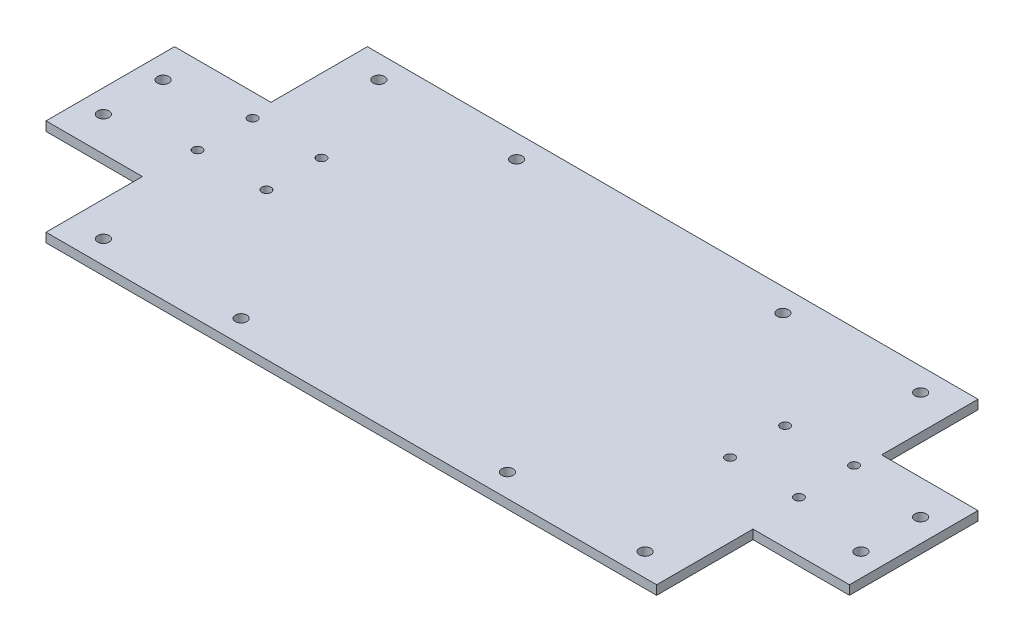
ISO-10303-21;
HEADER;
FILE_DESCRIPTION(('STEP AP214'),'2;1');
FILE_NAME('part.step','',(''),(''),'','','');
FILE_SCHEMA(('AUTOMOTIVE_DESIGN { 1 0 10303 214 1 1 1 1 }'));
ENDSEC;
DATA;
#1=APPLICATION_CONTEXT('core data for automotive mechanical design processes');
#2=APPLICATION_PROTOCOL_DEFINITION('international standard','automotive_design',2000,#1);
#3=PRODUCT_CONTEXT('',#1,'mechanical');
#4=PRODUCT('Part','Part','',(#3));
#5=PRODUCT_RELATED_PRODUCT_CATEGORY('part','',(#4));
#6=PRODUCT_DEFINITION_FORMATION('','',#4);
#7=PRODUCT_DEFINITION_CONTEXT('part definition',#1,'design');
#8=PRODUCT_DEFINITION('design','',#6,#7);
#9=PRODUCT_DEFINITION_SHAPE('','',#8);
#10=(LENGTH_UNIT() NAMED_UNIT(*) SI_UNIT(.MILLI.,.METRE.));
#11=(NAMED_UNIT(*) PLANE_ANGLE_UNIT() SI_UNIT($,.RADIAN.));
#12=(NAMED_UNIT(*) SI_UNIT($,.STERADIAN.) SOLID_ANGLE_UNIT());
#13=UNCERTAINTY_MEASURE_WITH_UNIT(LENGTH_MEASURE(1.E-05),#10,'distance_accuracy_value','');
#14=(GEOMETRIC_REPRESENTATION_CONTEXT(3) GLOBAL_UNCERTAINTY_ASSIGNED_CONTEXT((#13)) GLOBAL_UNIT_ASSIGNED_CONTEXT((#10,
#11,#12)) REPRESENTATION_CONTEXT('',''));
#15=CARTESIAN_POINT('',(0.,0.,0.));
#16=DIRECTION('',(0.,0.,1.));
#17=DIRECTION('',(1.,0.,0.));
#18=AXIS2_PLACEMENT_3D('',#15,#16,#17);
#19=CARTESIAN_POINT('',(0.,4.,0.));
#20=DIRECTION('',(0.,1.,0.));
#21=DIRECTION('',(0.,0.,1.));
#22=AXIS2_PLACEMENT_3D('',#19,#20,#21);
#23=PLANE('',#22);
#24=CARTESIAN_POINT('',(-131.,4.,-18.));
#25=DIRECTION('',(0.,1.,0.));
#26=DIRECTION('',(0.,0.,1.));
#27=AXIS2_PLACEMENT_3D('',#24,#25,#26);
#28=CIRCLE('',#27,2.);
#29=CARTESIAN_POINT('',(-131.,4.,-16.));
#30=VERTEX_POINT('',#29);
#31=EDGE_CURVE('E474',#30,#30,#28,.T.);
#32=ORIENTED_EDGE('',*,*,#31,.F.);
#33=EDGE_LOOP('',(#32));
#34=FACE_BOUND('',#33,.T.);
#35=CARTESIAN_POINT('',(101.,4.,-18.));
#36=DIRECTION('',(0.,-1.,0.));
#37=DIRECTION('',(0.,0.,-1.));
#38=AXIS2_PLACEMENT_3D('',#35,#36,#37);
#39=CIRCLE('',#38,2.);
#40=CARTESIAN_POINT('',(101.,4.,-20.));
#41=VERTEX_POINT('',#40);
#42=EDGE_CURVE('E470',#41,#41,#39,.T.);
#43=ORIENTED_EDGE('',*,*,#42,.T.);
#44=EDGE_LOOP('',(#43));
#45=FACE_BOUND('',#44,.T.);
#46=CARTESIAN_POINT('',(131.,4.,6.00000000000003));
#47=DIRECTION('',(0.,-1.,0.));
#48=DIRECTION('',(0.,0.,-1.));
#49=AXIS2_PLACEMENT_3D('',#46,#47,#48);
#50=CIRCLE('',#49,2.);
#51=CARTESIAN_POINT('',(131.,4.,4.00000000000004));
#52=VERTEX_POINT('',#51);
#53=EDGE_CURVE('E481',#52,#52,#50,.T.);
#54=ORIENTED_EDGE('',*,*,#53,.T.);
#55=EDGE_LOOP('',(#54));
#56=FACE_BOUND('',#55,.T.);
#57=CARTESIAN_POINT('',(-131.,4.,6.00000000000003));
#58=DIRECTION('',(0.,1.,0.));
#59=DIRECTION('',(0.,0.,1.));
#60=AXIS2_PLACEMENT_3D('',#57,#58,#59);
#61=CIRCLE('',#60,2.);
#62=CARTESIAN_POINT('',(-131.,4.,8.00000000000003));
#63=VERTEX_POINT('',#62);
#64=EDGE_CURVE('E164',#63,#63,#61,.T.);
#65=ORIENTED_EDGE('',*,*,#64,.F.);
#66=EDGE_LOOP('',(#65));
#67=FACE_BOUND('',#66,.T.);
#68=CARTESIAN_POINT('',(-118.,4.,-60.));
#69=DIRECTION('',(0.,1.,0.));
#70=DIRECTION('',(0.,0.,1.));
#71=AXIS2_PLACEMENT_3D('',#68,#69,#70);
#72=CIRCLE('',#71,2.5);
#73=CARTESIAN_POINT('',(-118.,4.,-57.5));
#74=VERTEX_POINT('',#73);
#75=EDGE_CURVE('E199',#74,#74,#72,.T.);
#76=ORIENTED_EDGE('',*,*,#75,.F.);
#77=EDGE_LOOP('',(#76));
#78=FACE_BOUND('',#77,.T.);
#79=CARTESIAN_POINT('',(165.,4.,-13.));
#80=DIRECTION('',(0.,1.,0.));
#81=DIRECTION('',(0.,0.,-1.));
#82=AXIS2_PLACEMENT_3D('',#79,#80,#81);
#83=CIRCLE('',#82,2.5);
#84=CARTESIAN_POINT('',(165.,4.,-15.5));
#85=VERTEX_POINT('',#84);
#86=EDGE_CURVE('E238',#85,#85,#83,.T.);
#87=ORIENTED_EDGE('',*,*,#86,.F.);
#88=EDGE_LOOP('',(#87));
#89=FACE_BOUND('',#88,.T.);
#90=CARTESIAN_POINT('',(165.,4.,13.));
#91=DIRECTION('',(0.,1.,0.));
#92=DIRECTION('',(0.,0.,1.));
#93=AXIS2_PLACEMENT_3D('',#90,#91,#92);
#94=CIRCLE('',#93,2.5);
#95=CARTESIAN_POINT('',(165.,4.,15.5));
#96=VERTEX_POINT('',#95);
#97=EDGE_CURVE('E232',#96,#96,#94,.T.);
#98=ORIENTED_EDGE('',*,*,#97,.F.);
#99=EDGE_LOOP('',(#98));
#100=FACE_BOUND('',#99,.T.);
#101=CARTESIAN_POINT('',(-165.,4.,13.));
#102=DIRECTION('',(0.,1.,0.));
#103=DIRECTION('',(0.,0.,-1.));
#104=AXIS2_PLACEMENT_3D('',#101,#102,#103);
#105=CIRCLE('',#104,2.5);
#106=CARTESIAN_POINT('',(-165.,4.,10.5));
#107=VERTEX_POINT('',#106);
#108=EDGE_CURVE('E226',#107,#107,#105,.T.);
#109=ORIENTED_EDGE('',*,*,#108,.F.);
#110=EDGE_LOOP('',(#109));
#111=FACE_BOUND('',#110,.T.);
#112=CARTESIAN_POINT('',(-165.,4.,-13.));
#113=DIRECTION('',(0.,1.,0.));
#114=DIRECTION('',(0.,0.,1.));
#115=AXIS2_PLACEMENT_3D('',#112,#113,#114);
#116=CIRCLE('',#115,2.5);
#117=CARTESIAN_POINT('',(-165.,4.,-10.5));
#118=VERTEX_POINT('',#117);
#119=EDGE_CURVE('E225',#118,#118,#116,.T.);
#120=ORIENTED_EDGE('',*,*,#119,.F.);
#121=EDGE_LOOP('',(#120));
#122=FACE_BOUND('',#121,.T.);
#123=DIRECTION('',(0.,0.,-1.));
#124=VECTOR('',#123,1.);
#125=CARTESIAN_POINT('',(-133.,4.,-70.));
#126=LINE('',#125,#124);
#127=CARTESIAN_POINT('',(-133.,4.,-28.));
#128=VERTEX_POINT('',#127);
#129=CARTESIAN_POINT('',(-133.,4.,-70.));
#130=VERTEX_POINT('',#129);
#131=EDGE_CURVE('E272',#128,#130,#126,.T.);
#132=ORIENTED_EDGE('',*,*,#131,.F.);
#133=DIRECTION('',(1.,0.,0.));
#134=VECTOR('',#133,1.);
#135=CARTESIAN_POINT('',(-175.,4.,-28.));
#136=LINE('',#135,#134);
#137=CARTESIAN_POINT('',(-175.,4.,-28.));
#138=VERTEX_POINT('',#137);
#139=EDGE_CURVE('E275',#138,#128,#136,.T.);
#140=ORIENTED_EDGE('',*,*,#139,.F.);
#141=DIRECTION('',(0.,0.,1.));
#142=VECTOR('',#141,1.);
#143=CARTESIAN_POINT('',(-175.,4.,70.));
#144=LINE('',#143,#142);
#145=CARTESIAN_POINT('',(-175.,4.,28.));
#146=VERTEX_POINT('',#145);
#147=EDGE_CURVE('E153',#138,#146,#144,.T.);
#148=ORIENTED_EDGE('',*,*,#147,.T.);
#149=DIRECTION('',(-1.,0.,0.));
#150=VECTOR('',#149,1.);
#151=CARTESIAN_POINT('',(-175.,4.,28.));
#152=LINE('',#151,#150);
#153=CARTESIAN_POINT('',(-133.,4.,28.));
#154=VERTEX_POINT('',#153);
#155=EDGE_CURVE('E293',#154,#146,#152,.T.);
#156=ORIENTED_EDGE('',*,*,#155,.F.);
#157=DIRECTION('',(0.,0.,-1.));
#158=VECTOR('',#157,1.);
#159=CARTESIAN_POINT('',(-133.,4.,70.));
#160=LINE('',#159,#158);
#161=CARTESIAN_POINT('',(-133.,4.,70.));
#162=VERTEX_POINT('',#161);
#163=EDGE_CURVE('E254',#162,#154,#160,.T.);
#164=ORIENTED_EDGE('',*,*,#163,.F.);
#165=DIRECTION('',(1.,0.,0.));
#166=VECTOR('',#165,1.);
#167=CARTESIAN_POINT('',(175.,4.,70.));
#168=LINE('',#167,#166);
#169=CARTESIAN_POINT('',(133.,4.,70.));
#170=VERTEX_POINT('',#169);
#171=EDGE_CURVE('E308',#162,#170,#168,.T.);
#172=ORIENTED_EDGE('',*,*,#171,.T.);
#173=DIRECTION('',(0.,0.,1.));
#174=VECTOR('',#173,1.);
#175=CARTESIAN_POINT('',(133.,4.,70.));
#176=LINE('',#175,#174);
#177=CARTESIAN_POINT('',(133.,4.,28.));
#178=VERTEX_POINT('',#177);
#179=EDGE_CURVE('E135',#178,#170,#176,.T.);
#180=ORIENTED_EDGE('',*,*,#179,.F.);
#181=DIRECTION('',(-1.,0.,0.));
#182=VECTOR('',#181,1.);
#183=CARTESIAN_POINT('',(175.,4.,28.));
#184=LINE('',#183,#182);
#185=CARTESIAN_POINT('',(175.,4.,28.));
#186=VERTEX_POINT('',#185);
#187=EDGE_CURVE('E247',#186,#178,#184,.T.);
#188=ORIENTED_EDGE('',*,*,#187,.F.);
#189=DIRECTION('',(0.,0.,-1.));
#190=VECTOR('',#189,1.);
#191=CARTESIAN_POINT('',(175.,4.,70.));
#192=LINE('',#191,#190);
#193=CARTESIAN_POINT('',(175.,4.,-28.));
#194=VERTEX_POINT('',#193);
#195=EDGE_CURVE('E42',#186,#194,#192,.T.);
#196=ORIENTED_EDGE('',*,*,#195,.T.);
#197=DIRECTION('',(1.,0.,0.));
#198=VECTOR('',#197,1.);
#199=CARTESIAN_POINT('',(175.,4.,-28.));
#200=LINE('',#199,#198);
#201=CARTESIAN_POINT('',(133.,4.,-28.));
#202=VERTEX_POINT('',#201);
#203=EDGE_CURVE('E258',#202,#194,#200,.T.);
#204=ORIENTED_EDGE('',*,*,#203,.F.);
#205=DIRECTION('',(0.,0.,1.));
#206=VECTOR('',#205,1.);
#207=CARTESIAN_POINT('',(133.,4.,-70.));
#208=LINE('',#207,#206);
#209=CARTESIAN_POINT('',(133.,4.,-70.));
#210=VERTEX_POINT('',#209);
#211=EDGE_CURVE('E261',#210,#202,#208,.T.);
#212=ORIENTED_EDGE('',*,*,#211,.F.);
#213=DIRECTION('',(-1.,0.,0.));
#214=VECTOR('',#213,1.);
#215=CARTESIAN_POINT('',(175.,4.,-70.));
#216=LINE('',#215,#214);
#217=EDGE_CURVE('E11',#210,#130,#216,.T.);
#218=ORIENTED_EDGE('',*,*,#217,.T.);
#219=EDGE_LOOP('',(#132,#140,#148,#156,#164,#172,#180,#188,#196,#204,#212,#218));
#220=FACE_BOUND('',#219,.T.);
#221=CARTESIAN_POINT('',(-118.,4.,60.));
#222=DIRECTION('',(0.,1.,0.));
#223=DIRECTION('',(0.,0.,-1.));
#224=AXIS2_PLACEMENT_3D('',#221,#222,#223);
#225=CIRCLE('',#224,2.5);
#226=CARTESIAN_POINT('',(-118.,4.,57.5));
#227=VERTEX_POINT('',#226);
#228=EDGE_CURVE('E183',#227,#227,#225,.T.);
#229=ORIENTED_EDGE('',*,*,#228,.F.);
#230=EDGE_LOOP('',(#229));
#231=FACE_BOUND('',#230,.T.);
#232=CARTESIAN_POINT('',(-58.,4.,60.));
#233=DIRECTION('',(0.,1.,0.));
#234=DIRECTION('',(0.,0.,-1.));
#235=AXIS2_PLACEMENT_3D('',#232,#233,#234);
#236=CIRCLE('',#235,2.5);
#237=CARTESIAN_POINT('',(-58.,4.,57.5));
#238=VERTEX_POINT('',#237);
#239=EDGE_CURVE('E192',#238,#238,#236,.T.);
#240=ORIENTED_EDGE('',*,*,#239,.F.);
#241=EDGE_LOOP('',(#240));
#242=FACE_BOUND('',#241,.T.);
#243=CARTESIAN_POINT('',(58.,4.,60.));
#244=DIRECTION('',(0.,1.,0.));
#245=DIRECTION('',(0.,0.,1.));
#246=AXIS2_PLACEMENT_3D('',#243,#244,#245);
#247=CIRCLE('',#246,2.5);
#248=CARTESIAN_POINT('',(58.,4.,62.5));
#249=VERTEX_POINT('',#248);
#250=EDGE_CURVE('E498',#249,#249,#247,.T.);
#251=ORIENTED_EDGE('',*,*,#250,.F.);
#252=EDGE_LOOP('',(#251));
#253=FACE_BOUND('',#252,.T.);
#254=CARTESIAN_POINT('',(118.,4.,60.));
#255=DIRECTION('',(0.,1.,0.));
#256=DIRECTION('',(0.,0.,1.));
#257=AXIS2_PLACEMENT_3D('',#254,#255,#256);
#258=CIRCLE('',#257,2.5);
#259=CARTESIAN_POINT('',(118.,4.,62.5));
#260=VERTEX_POINT('',#259);
#261=EDGE_CURVE('E218',#260,#260,#258,.T.);
#262=ORIENTED_EDGE('',*,*,#261,.F.);
#263=EDGE_LOOP('',(#262));
#264=FACE_BOUND('',#263,.T.);
#265=CARTESIAN_POINT('',(118.,4.,-60.));
#266=DIRECTION('',(0.,1.,0.));
#267=DIRECTION('',(0.,0.,-1.));
#268=AXIS2_PLACEMENT_3D('',#265,#266,#267);
#269=CIRCLE('',#268,2.5);
#270=CARTESIAN_POINT('',(118.,4.,-62.5));
#271=VERTEX_POINT('',#270);
#272=EDGE_CURVE('E212',#271,#271,#269,.T.);
#273=ORIENTED_EDGE('',*,*,#272,.F.);
#274=EDGE_LOOP('',(#273));
#275=FACE_BOUND('',#274,.T.);
#276=CARTESIAN_POINT('',(-58.,4.,-60.));
#277=DIRECTION('',(0.,1.,0.));
#278=DIRECTION('',(0.,0.,1.));
#279=AXIS2_PLACEMENT_3D('',#276,#277,#278);
#280=CIRCLE('',#279,2.5);
#281=CARTESIAN_POINT('',(-58.,4.,-57.5));
#282=VERTEX_POINT('',#281);
#283=EDGE_CURVE('E206',#282,#282,#280,.T.);
#284=ORIENTED_EDGE('',*,*,#283,.F.);
#285=EDGE_LOOP('',(#284));
#286=FACE_BOUND('',#285,.T.);
#287=CARTESIAN_POINT('',(58.,4.,-60.));
#288=DIRECTION('',(0.,1.,0.));
#289=DIRECTION('',(0.,0.,-1.));
#290=AXIS2_PLACEMENT_3D('',#287,#288,#289);
#291=CIRCLE('',#290,2.5);
#292=CARTESIAN_POINT('',(58.,4.,-62.5));
#293=VERTEX_POINT('',#292);
#294=EDGE_CURVE('E200',#293,#293,#291,.T.);
#295=ORIENTED_EDGE('',*,*,#294,.F.);
#296=EDGE_LOOP('',(#295));
#297=FACE_BOUND('',#296,.T.);
#298=CARTESIAN_POINT('',(131.,4.,-18.));
#299=DIRECTION('',(0.,-1.,0.));
#300=DIRECTION('',(0.,0.,-1.));
#301=AXIS2_PLACEMENT_3D('',#298,#299,#300);
#302=CIRCLE('',#301,2.);
#303=CARTESIAN_POINT('',(131.,4.,-20.));
#304=VERTEX_POINT('',#303);
#305=EDGE_CURVE('E475',#304,#304,#302,.T.);
#306=ORIENTED_EDGE('',*,*,#305,.T.);
#307=EDGE_LOOP('',(#306));
#308=FACE_BOUND('',#307,.T.);
#309=CARTESIAN_POINT('',(-101.,4.,6.00000000000003));
#310=DIRECTION('',(0.,1.,0.));
#311=DIRECTION('',(0.,0.,1.));
#312=AXIS2_PLACEMENT_3D('',#309,#310,#311);
#313=CIRCLE('',#312,2.);
#314=CARTESIAN_POINT('',(-101.,4.,8.00000000000002));
#315=VERTEX_POINT('',#314);
#316=EDGE_CURVE('E489',#315,#315,#313,.T.);
#317=ORIENTED_EDGE('',*,*,#316,.F.);
#318=EDGE_LOOP('',(#317));
#319=FACE_BOUND('',#318,.T.);
#320=CARTESIAN_POINT('',(-101.,4.,-18.));
#321=DIRECTION('',(0.,1.,0.));
#322=DIRECTION('',(0.,0.,1.));
#323=AXIS2_PLACEMENT_3D('',#320,#321,#322);
#324=CIRCLE('',#323,2.);
#325=CARTESIAN_POINT('',(-101.,4.,-16.));
#326=VERTEX_POINT('',#325);
#327=EDGE_CURVE('E487',#326,#326,#324,.T.);
#328=ORIENTED_EDGE('',*,*,#327,.F.);
#329=EDGE_LOOP('',(#328));
#330=FACE_BOUND('',#329,.T.);
#331=CARTESIAN_POINT('',(101.,4.,6.00000000000003));
#332=DIRECTION('',(0.,1.,0.));
#333=DIRECTION('',(0.,0.,1.));
#334=AXIS2_PLACEMENT_3D('',#331,#332,#333);
#335=CIRCLE('',#334,2.);
#336=CARTESIAN_POINT('',(101.,4.,8.00000000000002));
#337=VERTEX_POINT('',#336);
#338=EDGE_CURVE('E478',#337,#337,#335,.F.);
#339=ORIENTED_EDGE('',*,*,#338,.T.);
#340=EDGE_LOOP('',(#339));
#341=FACE_BOUND('',#340,.T.);
#342=ADVANCED_FACE('F33',(#34,#45,#56,#67,#78,#89,#100,#111,#122,#220,#231,#242,#253,#264,#275,
#286,#297,#308,#319,#330,#341),#23,.T.);
#343=CARTESIAN_POINT('',(0.,0.,0.));
#344=DIRECTION('',(0.,1.,0.));
#345=DIRECTION('',(0.,0.,1.));
#346=AXIS2_PLACEMENT_3D('',#343,#344,#345);
#347=PLANE('',#346);
#348=CARTESIAN_POINT('',(-131.,0.,-18.));
#349=DIRECTION('',(0.,1.,0.));
#350=DIRECTION('',(0.,0.,1.));
#351=AXIS2_PLACEMENT_3D('',#348,#349,#350);
#352=CIRCLE('',#351,2.);
#353=CARTESIAN_POINT('',(-131.,0.,-16.));
#354=VERTEX_POINT('',#353);
#355=EDGE_CURVE('E37',#354,#354,#352,.T.);
#356=ORIENTED_EDGE('',*,*,#355,.T.);
#357=EDGE_LOOP('',(#356));
#358=FACE_BOUND('',#357,.T.);
#359=CARTESIAN_POINT('',(-101.,0.,-18.));
#360=DIRECTION('',(0.,1.,0.));
#361=DIRECTION('',(0.,0.,1.));
#362=AXIS2_PLACEMENT_3D('',#359,#360,#361);
#363=CIRCLE('',#362,2.);
#364=CARTESIAN_POINT('',(-101.,0.,-16.));
#365=VERTEX_POINT('',#364);
#366=EDGE_CURVE('E176',#365,#365,#363,.T.);
#367=ORIENTED_EDGE('',*,*,#366,.T.);
#368=EDGE_LOOP('',(#367));
#369=FACE_BOUND('',#368,.T.);
#370=CARTESIAN_POINT('',(-101.,0.,6.00000000000003));
#371=DIRECTION('',(0.,1.,0.));
#372=DIRECTION('',(0.,0.,1.));
#373=AXIS2_PLACEMENT_3D('',#370,#371,#372);
#374=CIRCLE('',#373,2.);
#375=CARTESIAN_POINT('',(-101.,0.,8.00000000000002));
#376=VERTEX_POINT('',#375);
#377=EDGE_CURVE('E173',#376,#376,#374,.T.);
#378=ORIENTED_EDGE('',*,*,#377,.T.);
#379=EDGE_LOOP('',(#378));
#380=FACE_BOUND('',#379,.T.);
#381=CARTESIAN_POINT('',(-131.,0.,6.00000000000003));
#382=DIRECTION('',(0.,1.,0.));
#383=DIRECTION('',(0.,0.,1.));
#384=AXIS2_PLACEMENT_3D('',#381,#382,#383);
#385=CIRCLE('',#384,2.);
#386=CARTESIAN_POINT('',(-131.,0.,8.00000000000003));
#387=VERTEX_POINT('',#386);
#388=EDGE_CURVE('E160',#387,#387,#385,.T.);
#389=ORIENTED_EDGE('',*,*,#388,.T.);
#390=EDGE_LOOP('',(#389));
#391=FACE_BOUND('',#390,.T.);
#392=CARTESIAN_POINT('',(-118.,0.,-60.));
#393=DIRECTION('',(0.,1.,0.));
#394=DIRECTION('',(0.,0.,1.));
#395=AXIS2_PLACEMENT_3D('',#392,#393,#394);
#396=CIRCLE('',#395,2.5);
#397=CARTESIAN_POINT('',(-118.,0.,-57.5));
#398=VERTEX_POINT('',#397);
#399=EDGE_CURVE('E241',#398,#398,#396,.T.);
#400=ORIENTED_EDGE('',*,*,#399,.T.);
#401=EDGE_LOOP('',(#400));
#402=FACE_BOUND('',#401,.T.);
#403=CARTESIAN_POINT('',(165.,0.,-13.));
#404=DIRECTION('',(0.,1.,0.));
#405=DIRECTION('',(0.,0.,-1.));
#406=AXIS2_PLACEMENT_3D('',#403,#404,#405);
#407=CIRCLE('',#406,2.5);
#408=CARTESIAN_POINT('',(165.,0.,-15.5));
#409=VERTEX_POINT('',#408);
#410=EDGE_CURVE('E235',#409,#409,#407,.T.);
#411=ORIENTED_EDGE('',*,*,#410,.T.);
#412=EDGE_LOOP('',(#411));
#413=FACE_BOUND('',#412,.T.);
#414=CARTESIAN_POINT('',(165.,0.,13.));
#415=DIRECTION('',(0.,1.,0.));
#416=DIRECTION('',(0.,0.,1.));
#417=AXIS2_PLACEMENT_3D('',#414,#415,#416);
#418=CIRCLE('',#417,2.5);
#419=CARTESIAN_POINT('',(165.,0.,15.5));
#420=VERTEX_POINT('',#419);
#421=EDGE_CURVE('E229',#420,#420,#418,.T.);
#422=ORIENTED_EDGE('',*,*,#421,.T.);
#423=EDGE_LOOP('',(#422));
#424=FACE_BOUND('',#423,.T.);
#425=CARTESIAN_POINT('',(-165.,0.,13.));
#426=DIRECTION('',(0.,1.,0.));
#427=DIRECTION('',(0.,0.,-1.));
#428=AXIS2_PLACEMENT_3D('',#425,#426,#427);
#429=CIRCLE('',#428,2.5);
#430=CARTESIAN_POINT('',(-165.,0.,10.5));
#431=VERTEX_POINT('',#430);
#432=EDGE_CURVE('E222',#431,#431,#429,.T.);
#433=ORIENTED_EDGE('',*,*,#432,.T.);
#434=EDGE_LOOP('',(#433));
#435=FACE_BOUND('',#434,.T.);
#436=CARTESIAN_POINT('',(-165.,0.,-13.));
#437=DIRECTION('',(0.,1.,0.));
#438=DIRECTION('',(0.,0.,1.));
#439=AXIS2_PLACEMENT_3D('',#436,#437,#438);
#440=CIRCLE('',#439,2.5);
#441=CARTESIAN_POINT('',(-165.,0.,-10.5));
#442=VERTEX_POINT('',#441);
#443=EDGE_CURVE('E278',#442,#442,#440,.T.);
#444=ORIENTED_EDGE('',*,*,#443,.T.);
#445=EDGE_LOOP('',(#444));
#446=FACE_BOUND('',#445,.T.);
#447=CARTESIAN_POINT('',(-118.,0.,60.));
#448=DIRECTION('',(0.,1.,0.));
#449=DIRECTION('',(0.,0.,-1.));
#450=AXIS2_PLACEMENT_3D('',#447,#448,#449);
#451=CIRCLE('',#450,2.5);
#452=CARTESIAN_POINT('',(-118.,0.,57.5));
#453=VERTEX_POINT('',#452);
#454=EDGE_CURVE('E187',#453,#453,#451,.T.);
#455=ORIENTED_EDGE('',*,*,#454,.T.);
#456=EDGE_LOOP('',(#455));
#457=FACE_BOUND('',#456,.T.);
#458=CARTESIAN_POINT('',(-58.,0.,60.));
#459=DIRECTION('',(0.,1.,0.));
#460=DIRECTION('',(0.,0.,-1.));
#461=AXIS2_PLACEMENT_3D('',#458,#459,#460);
#462=CIRCLE('',#461,2.5);
#463=CARTESIAN_POINT('',(-58.,0.,57.5));
#464=VERTEX_POINT('',#463);
#465=EDGE_CURVE('E501',#464,#464,#462,.T.);
#466=ORIENTED_EDGE('',*,*,#465,.T.);
#467=EDGE_LOOP('',(#466));
#468=FACE_BOUND('',#467,.T.);
#469=CARTESIAN_POINT('',(58.,0.,60.));
#470=DIRECTION('',(0.,1.,0.));
#471=DIRECTION('',(0.,0.,1.));
#472=AXIS2_PLACEMENT_3D('',#469,#470,#471);
#473=CIRCLE('',#472,2.5);
#474=CARTESIAN_POINT('',(58.,0.,62.5));
#475=VERTEX_POINT('',#474);
#476=EDGE_CURVE('E221',#475,#475,#473,.T.);
#477=ORIENTED_EDGE('',*,*,#476,.T.);
#478=EDGE_LOOP('',(#477));
#479=FACE_BOUND('',#478,.T.);
#480=CARTESIAN_POINT('',(118.,0.,60.));
#481=DIRECTION('',(0.,1.,0.));
#482=DIRECTION('',(0.,0.,1.));
#483=AXIS2_PLACEMENT_3D('',#480,#481,#482);
#484=CIRCLE('',#483,2.5);
#485=CARTESIAN_POINT('',(118.,0.,62.5));
#486=VERTEX_POINT('',#485);
#487=EDGE_CURVE('E215',#486,#486,#484,.T.);
#488=ORIENTED_EDGE('',*,*,#487,.T.);
#489=EDGE_LOOP('',(#488));
#490=FACE_BOUND('',#489,.T.);
#491=CARTESIAN_POINT('',(118.,0.,-60.));
#492=DIRECTION('',(0.,1.,0.));
#493=DIRECTION('',(0.,0.,-1.));
#494=AXIS2_PLACEMENT_3D('',#491,#492,#493);
#495=CIRCLE('',#494,2.5);
#496=CARTESIAN_POINT('',(118.,0.,-62.5));
#497=VERTEX_POINT('',#496);
#498=EDGE_CURVE('E209',#497,#497,#495,.T.);
#499=ORIENTED_EDGE('',*,*,#498,.T.);
#500=EDGE_LOOP('',(#499));
#501=FACE_BOUND('',#500,.T.);
#502=CARTESIAN_POINT('',(-58.,0.,-60.));
#503=DIRECTION('',(0.,1.,0.));
#504=DIRECTION('',(0.,0.,1.));
#505=AXIS2_PLACEMENT_3D('',#502,#503,#504);
#506=CIRCLE('',#505,2.5);
#507=CARTESIAN_POINT('',(-58.,0.,-57.5));
#508=VERTEX_POINT('',#507);
#509=EDGE_CURVE('E203',#508,#508,#506,.T.);
#510=ORIENTED_EDGE('',*,*,#509,.T.);
#511=EDGE_LOOP('',(#510));
#512=FACE_BOUND('',#511,.T.);
#513=CARTESIAN_POINT('',(58.,0.,-60.));
#514=DIRECTION('',(0.,1.,0.));
#515=DIRECTION('',(0.,0.,-1.));
#516=AXIS2_PLACEMENT_3D('',#513,#514,#515);
#517=CIRCLE('',#516,2.5);
#518=CARTESIAN_POINT('',(58.,0.,-62.5));
#519=VERTEX_POINT('',#518);
#520=EDGE_CURVE('E196',#519,#519,#517,.T.);
#521=ORIENTED_EDGE('',*,*,#520,.T.);
#522=EDGE_LOOP('',(#521));
#523=FACE_BOUND('',#522,.T.);
#524=DIRECTION('',(1.,0.,0.));
#525=VECTOR('',#524,1.);
#526=CARTESIAN_POINT('',(-175.,0.,-28.));
#527=LINE('',#526,#525);
#528=CARTESIAN_POINT('',(-175.,0.,-28.));
#529=VERTEX_POINT('',#528);
#530=CARTESIAN_POINT('',(-133.,0.,-28.));
#531=VERTEX_POINT('',#530);
#532=EDGE_CURVE('E270',#529,#531,#527,.T.);
#533=ORIENTED_EDGE('',*,*,#532,.T.);
#534=DIRECTION('',(0.,0.,-1.));
#535=VECTOR('',#534,1.);
#536=CARTESIAN_POINT('',(-133.,0.,-70.));
#537=LINE('',#536,#535);
#538=CARTESIAN_POINT('',(-133.,0.,-70.));
#539=VERTEX_POINT('',#538);
#540=EDGE_CURVE('E50',#531,#539,#537,.T.);
#541=ORIENTED_EDGE('',*,*,#540,.T.);
#542=DIRECTION('',(-1.,0.,0.));
#543=VECTOR('',#542,1.);
#544=CARTESIAN_POINT('',(175.,0.,-70.));
#545=LINE('',#544,#543);
#546=CARTESIAN_POINT('',(133.,0.,-70.));
#547=VERTEX_POINT('',#546);
#548=EDGE_CURVE('E149',#547,#539,#545,.T.);
#549=ORIENTED_EDGE('',*,*,#548,.F.);
#550=DIRECTION('',(0.,0.,1.));
#551=VECTOR('',#550,1.);
#552=CARTESIAN_POINT('',(133.,0.,-70.));
#553=LINE('',#552,#551);
#554=CARTESIAN_POINT('',(133.,0.,-28.));
#555=VERTEX_POINT('',#554);
#556=EDGE_CURVE('E256',#547,#555,#553,.T.);
#557=ORIENTED_EDGE('',*,*,#556,.T.);
#558=DIRECTION('',(1.,0.,0.));
#559=VECTOR('',#558,1.);
#560=CARTESIAN_POINT('',(175.,0.,-28.));
#561=LINE('',#560,#559);
#562=CARTESIAN_POINT('',(175.,0.,-28.));
#563=VERTEX_POINT('',#562);
#564=EDGE_CURVE('E58',#555,#563,#561,.T.);
#565=ORIENTED_EDGE('',*,*,#564,.T.);
#566=DIRECTION('',(0.,0.,-1.));
#567=VECTOR('',#566,1.);
#568=CARTESIAN_POINT('',(175.,0.,70.));
#569=LINE('',#568,#567);
#570=CARTESIAN_POINT('',(175.,0.,28.));
#571=VERTEX_POINT('',#570);
#572=EDGE_CURVE('E142',#571,#563,#569,.T.);
#573=ORIENTED_EDGE('',*,*,#572,.F.);
#574=DIRECTION('',(-1.,0.,0.));
#575=VECTOR('',#574,1.);
#576=CARTESIAN_POINT('',(175.,0.,28.));
#577=LINE('',#576,#575);
#578=CARTESIAN_POINT('',(133.,0.,28.));
#579=VERTEX_POINT('',#578);
#580=EDGE_CURVE('E124',#571,#579,#577,.T.);
#581=ORIENTED_EDGE('',*,*,#580,.T.);
#582=DIRECTION('',(0.,0.,1.));
#583=VECTOR('',#582,1.);
#584=CARTESIAN_POINT('',(133.,0.,70.));
#585=LINE('',#584,#583);
#586=CARTESIAN_POINT('',(133.,0.,70.));
#587=VERTEX_POINT('',#586);
#588=EDGE_CURVE('E134',#579,#587,#585,.T.);
#589=ORIENTED_EDGE('',*,*,#588,.T.);
#590=DIRECTION('',(1.,0.,0.));
#591=VECTOR('',#590,1.);
#592=CARTESIAN_POINT('',(175.,0.,70.));
#593=LINE('',#592,#591);
#594=CARTESIAN_POINT('',(-133.,0.,70.));
#595=VERTEX_POINT('',#594);
#596=EDGE_CURVE('E150',#595,#587,#593,.T.);
#597=ORIENTED_EDGE('',*,*,#596,.F.);
#598=DIRECTION('',(0.,0.,-1.));
#599=VECTOR('',#598,1.);
#600=CARTESIAN_POINT('',(-133.,0.,70.));
#601=LINE('',#600,#599);
#602=CARTESIAN_POINT('',(-133.,0.,28.));
#603=VERTEX_POINT('',#602);
#604=EDGE_CURVE('E289',#595,#603,#601,.T.);
#605=ORIENTED_EDGE('',*,*,#604,.T.);
#606=DIRECTION('',(-1.,0.,0.));
#607=VECTOR('',#606,1.);
#608=CARTESIAN_POINT('',(-175.,0.,28.));
#609=LINE('',#608,#607);
#610=CARTESIAN_POINT('',(-175.,0.,28.));
#611=VERTEX_POINT('',#610);
#612=EDGE_CURVE('E292',#603,#611,#609,.T.);
#613=ORIENTED_EDGE('',*,*,#612,.T.);
#614=DIRECTION('',(0.,0.,1.));
#615=VECTOR('',#614,1.);
#616=CARTESIAN_POINT('',(-175.,0.,70.));
#617=LINE('',#616,#615);
#618=EDGE_CURVE('E156',#529,#611,#617,.T.);
#619=ORIENTED_EDGE('',*,*,#618,.F.);
#620=EDGE_LOOP('',(#533,#541,#549,#557,#565,#573,#581,#589,#597,#605,#613,#619));
#621=FACE_BOUND('',#620,.T.);
#622=CARTESIAN_POINT('',(131.,0.,6.00000000000003));
#623=DIRECTION('',(0.,1.,0.));
#624=DIRECTION('',(0.,0.,1.));
#625=AXIS2_PLACEMENT_3D('',#622,#623,#624);
#626=CIRCLE('',#625,2.);
#627=CARTESIAN_POINT('',(131.,0.,8.00000000000003));
#628=VERTEX_POINT('',#627);
#629=EDGE_CURVE('E163',#628,#628,#626,.F.);
#630=ORIENTED_EDGE('',*,*,#629,.F.);
#631=EDGE_LOOP('',(#630));
#632=FACE_BOUND('',#631,.T.);
#633=CARTESIAN_POINT('',(131.,0.,-18.));
#634=DIRECTION('',(0.,1.,0.));
#635=DIRECTION('',(0.,0.,1.));
#636=AXIS2_PLACEMENT_3D('',#633,#634,#635);
#637=CIRCLE('',#636,2.);
#638=CARTESIAN_POINT('',(131.,0.,-16.));
#639=VERTEX_POINT('',#638);
#640=EDGE_CURVE('E167',#639,#639,#637,.F.);
#641=ORIENTED_EDGE('',*,*,#640,.F.);
#642=EDGE_LOOP('',(#641));
#643=FACE_BOUND('',#642,.T.);
#644=CARTESIAN_POINT('',(101.,0.,-18.));
#645=DIRECTION('',(0.,1.,0.));
#646=DIRECTION('',(0.,0.,1.));
#647=AXIS2_PLACEMENT_3D('',#644,#645,#646);
#648=CIRCLE('',#647,2.);
#649=CARTESIAN_POINT('',(101.,0.,-16.));
#650=VERTEX_POINT('',#649);
#651=EDGE_CURVE('E170',#650,#650,#648,.F.);
#652=ORIENTED_EDGE('',*,*,#651,.F.);
#653=EDGE_LOOP('',(#652));
#654=FACE_BOUND('',#653,.T.);
#655=CARTESIAN_POINT('',(101.,0.,6.00000000000003));
#656=DIRECTION('',(0.,1.,0.));
#657=DIRECTION('',(0.,0.,1.));
#658=AXIS2_PLACEMENT_3D('',#655,#656,#657);
#659=CIRCLE('',#658,2.);
#660=CARTESIAN_POINT('',(101.,0.,8.00000000000002));
#661=VERTEX_POINT('',#660);
#662=EDGE_CURVE('E178',#661,#661,#659,.F.);
#663=ORIENTED_EDGE('',*,*,#662,.F.);
#664=EDGE_LOOP('',(#663));
#665=FACE_BOUND('',#664,.T.);
#666=ADVANCED_FACE('F146',(#358,#369,#380,#391,#402,#413,#424,#435,#446,#457,#468,#479,#490,
#501,#512,#523,#621,#632,#643,#654,#665),#347,.F.);
#667=CARTESIAN_POINT('',(-175.,4.,70.));
#668=DIRECTION('',(1.,0.,0.));
#669=DIRECTION('',(0.,0.,-1.));
#670=AXIS2_PLACEMENT_3D('',#667,#668,#669);
#671=PLANE('',#670);
#672=ORIENTED_EDGE('',*,*,#147,.F.);
#673=DIRECTION('',(0.,1.,0.));
#674=VECTOR('',#673,1.);
#675=CARTESIAN_POINT('',(-175.,0.,-28.));
#676=LINE('',#675,#674);
#677=EDGE_CURVE('E274',#529,#138,#676,.T.);
#678=ORIENTED_EDGE('',*,*,#677,.F.);
#679=ORIENTED_EDGE('',*,*,#618,.T.);
#680=DIRECTION('',(0.,1.,0.));
#681=VECTOR('',#680,1.);
#682=CARTESIAN_POINT('',(-175.,0.,28.));
#683=LINE('',#682,#681);
#684=EDGE_CURVE('E300',#611,#146,#683,.T.);
#685=ORIENTED_EDGE('',*,*,#684,.T.);
#686=EDGE_LOOP('',(#672,#678,#679,#685));
#687=FACE_BOUND('',#686,.T.);
#688=ADVANCED_FACE('F35',(#687),#671,.F.);
#689=CARTESIAN_POINT('',(175.,4.,70.));
#690=DIRECTION('',(0.,0.,-1.));
#691=DIRECTION('',(-1.,0.,0.));
#692=AXIS2_PLACEMENT_3D('',#689,#690,#691);
#693=PLANE('',#692);
#694=ORIENTED_EDGE('',*,*,#596,.T.);
#695=DIRECTION('',(0.,1.,0.));
#696=VECTOR('',#695,1.);
#697=CARTESIAN_POINT('',(133.,0.,70.));
#698=LINE('',#697,#696);
#699=EDGE_CURVE('E251',#587,#170,#698,.T.);
#700=ORIENTED_EDGE('',*,*,#699,.T.);
#701=ORIENTED_EDGE('',*,*,#171,.F.);
#702=DIRECTION('',(0.,1.,0.));
#703=VECTOR('',#702,1.);
#704=CARTESIAN_POINT('',(-133.,0.,70.));
#705=LINE('',#704,#703);
#706=EDGE_CURVE('E296',#595,#162,#705,.T.);
#707=ORIENTED_EDGE('',*,*,#706,.F.);
#708=EDGE_LOOP('',(#694,#700,#701,#707));
#709=FACE_BOUND('',#708,.T.);
#710=ADVANCED_FACE('F347',(#709),#693,.F.);
#711=CARTESIAN_POINT('',(175.,4.,70.));
#712=DIRECTION('',(-1.,0.,0.));
#713=DIRECTION('',(0.,0.,1.));
#714=AXIS2_PLACEMENT_3D('',#711,#712,#713);
#715=PLANE('',#714);
#716=ORIENTED_EDGE('',*,*,#572,.T.);
#717=DIRECTION('',(0.,1.,0.));
#718=VECTOR('',#717,1.);
#719=CARTESIAN_POINT('',(175.,0.,-28.));
#720=LINE('',#719,#718);
#721=EDGE_CURVE('E249',#563,#194,#720,.T.);
#722=ORIENTED_EDGE('',*,*,#721,.T.);
#723=ORIENTED_EDGE('',*,*,#195,.F.);
#724=DIRECTION('',(0.,1.,0.));
#725=VECTOR('',#724,1.);
#726=CARTESIAN_POINT('',(175.,0.,28.));
#727=LINE('',#726,#725);
#728=EDGE_CURVE('E128',#571,#186,#727,.T.);
#729=ORIENTED_EDGE('',*,*,#728,.F.);
#730=EDGE_LOOP('',(#716,#722,#723,#729));
#731=FACE_BOUND('',#730,.T.);
#732=ADVANCED_FACE('F140',(#731),#715,.F.);
#733=CARTESIAN_POINT('',(175.,4.,-70.));
#734=DIRECTION('',(0.,0.,1.));
#735=DIRECTION('',(1.,0.,0.));
#736=AXIS2_PLACEMENT_3D('',#733,#734,#735);
#737=PLANE('',#736);
#738=ORIENTED_EDGE('',*,*,#548,.T.);
#739=DIRECTION('',(0.,1.,0.));
#740=VECTOR('',#739,1.);
#741=CARTESIAN_POINT('',(-133.,0.,-70.));
#742=LINE('',#741,#740);
#743=EDGE_CURVE('E264',#539,#130,#742,.T.);
#744=ORIENTED_EDGE('',*,*,#743,.T.);
#745=ORIENTED_EDGE('',*,*,#217,.F.);
#746=DIRECTION('',(0.,1.,0.));
#747=VECTOR('',#746,1.);
#748=CARTESIAN_POINT('',(133.,0.,-70.));
#749=LINE('',#748,#747);
#750=EDGE_CURVE('E260',#547,#210,#749,.T.);
#751=ORIENTED_EDGE('',*,*,#750,.F.);
#752=EDGE_LOOP('',(#738,#744,#745,#751));
#753=FACE_BOUND('',#752,.T.);
#754=ADVANCED_FACE('F335',(#753),#737,.F.);
#755=CARTESIAN_POINT('',(-175.,0.,28.));
#756=DIRECTION('',(0.,0.,-1.));
#757=DIRECTION('',(-1.,0.,0.));
#758=AXIS2_PLACEMENT_3D('',#755,#756,#757);
#759=PLANE('',#758);
#760=ORIENTED_EDGE('',*,*,#155,.T.);
#761=ORIENTED_EDGE('',*,*,#684,.F.);
#762=ORIENTED_EDGE('',*,*,#612,.F.);
#763=DIRECTION('',(0.,1.,0.));
#764=VECTOR('',#763,1.);
#765=CARTESIAN_POINT('',(-133.,0.,28.));
#766=LINE('',#765,#764);
#767=EDGE_CURVE('E303',#603,#154,#766,.T.);
#768=ORIENTED_EDGE('',*,*,#767,.T.);
#769=EDGE_LOOP('',(#760,#761,#762,#768));
#770=FACE_BOUND('',#769,.T.);
#771=ADVANCED_FACE('F319',(#770),#759,.F.);
#772=CARTESIAN_POINT('',(-133.,0.,70.));
#773=DIRECTION('',(1.,0.,0.));
#774=DIRECTION('',(0.,0.,-1.));
#775=AXIS2_PLACEMENT_3D('',#772,#773,#774);
#776=PLANE('',#775);
#777=ORIENTED_EDGE('',*,*,#163,.T.);
#778=ORIENTED_EDGE('',*,*,#767,.F.);
#779=ORIENTED_EDGE('',*,*,#604,.F.);
#780=ORIENTED_EDGE('',*,*,#706,.T.);
#781=EDGE_LOOP('',(#777,#778,#779,#780));
#782=FACE_BOUND('',#781,.T.);
#783=ADVANCED_FACE('F321',(#782),#776,.F.);
#784=CARTESIAN_POINT('',(58.,0.,-60.));
#785=DIRECTION('',(0.,1.,0.));
#786=DIRECTION('',(0.,0.,1.));
#787=AXIS2_PLACEMENT_3D('',#784,#785,#786);
#788=CYLINDRICAL_SURFACE('',#787,2.5);
#789=ORIENTED_EDGE('',*,*,#520,.F.);
#790=EDGE_LOOP('',(#789));
#791=FACE_BOUND('',#790,.T.);
#792=ORIENTED_EDGE('',*,*,#294,.T.);
#793=EDGE_LOOP('',(#792));
#794=FACE_BOUND('',#793,.T.);
#795=ADVANCED_FACE('F373',(#791,#794),#788,.F.);
#796=CARTESIAN_POINT('',(-58.,0.,-60.));
#797=DIRECTION('',(0.,1.,0.));
#798=DIRECTION('',(0.,0.,1.));
#799=AXIS2_PLACEMENT_3D('',#796,#797,#798);
#800=CYLINDRICAL_SURFACE('',#799,2.5);
#801=ORIENTED_EDGE('',*,*,#509,.F.);
#802=EDGE_LOOP('',(#801));
#803=FACE_BOUND('',#802,.T.);
#804=ORIENTED_EDGE('',*,*,#283,.T.);
#805=EDGE_LOOP('',(#804));
#806=FACE_BOUND('',#805,.T.);
#807=ADVANCED_FACE('F417',(#803,#806),#800,.F.);
#808=CARTESIAN_POINT('',(118.,0.,-60.));
#809=DIRECTION('',(0.,1.,0.));
#810=DIRECTION('',(0.,0.,1.));
#811=AXIS2_PLACEMENT_3D('',#808,#809,#810);
#812=CYLINDRICAL_SURFACE('',#811,2.5);
#813=ORIENTED_EDGE('',*,*,#498,.F.);
#814=EDGE_LOOP('',(#813));
#815=FACE_BOUND('',#814,.T.);
#816=ORIENTED_EDGE('',*,*,#272,.T.);
#817=EDGE_LOOP('',(#816));
#818=FACE_BOUND('',#817,.T.);
#819=ADVANCED_FACE('F413',(#815,#818),#812,.F.);
#820=CARTESIAN_POINT('',(118.,0.,60.));
#821=DIRECTION('',(0.,1.,0.));
#822=DIRECTION('',(0.,0.,1.));
#823=AXIS2_PLACEMENT_3D('',#820,#821,#822);
#824=CYLINDRICAL_SURFACE('',#823,2.5);
#825=ORIENTED_EDGE('',*,*,#487,.F.);
#826=EDGE_LOOP('',(#825));
#827=FACE_BOUND('',#826,.T.);
#828=ORIENTED_EDGE('',*,*,#261,.T.);
#829=EDGE_LOOP('',(#828));
#830=FACE_BOUND('',#829,.T.);
#831=ADVANCED_FACE('F409',(#827,#830),#824,.F.);
#832=CARTESIAN_POINT('',(58.,0.,60.));
#833=DIRECTION('',(0.,1.,0.));
#834=DIRECTION('',(0.,0.,1.));
#835=AXIS2_PLACEMENT_3D('',#832,#833,#834);
#836=CYLINDRICAL_SURFACE('',#835,2.5);
#837=ORIENTED_EDGE('',*,*,#476,.F.);
#838=EDGE_LOOP('',(#837));
#839=FACE_BOUND('',#838,.T.);
#840=ORIENTED_EDGE('',*,*,#250,.T.);
#841=EDGE_LOOP('',(#840));
#842=FACE_BOUND('',#841,.T.);
#843=ADVANCED_FACE('F412',(#839,#842),#836,.F.);
#844=CARTESIAN_POINT('',(-58.,0.,60.));
#845=DIRECTION('',(0.,1.,0.));
#846=DIRECTION('',(0.,0.,1.));
#847=AXIS2_PLACEMENT_3D('',#844,#845,#846);
#848=CYLINDRICAL_SURFACE('',#847,2.5);
#849=ORIENTED_EDGE('',*,*,#465,.F.);
#850=EDGE_LOOP('',(#849));
#851=FACE_BOUND('',#850,.T.);
#852=ORIENTED_EDGE('',*,*,#239,.T.);
#853=EDGE_LOOP('',(#852));
#854=FACE_BOUND('',#853,.T.);
#855=ADVANCED_FACE('F427',(#851,#854),#848,.F.);
#856=CARTESIAN_POINT('',(-118.,0.,60.));
#857=DIRECTION('',(0.,1.,0.));
#858=DIRECTION('',(0.,0.,1.));
#859=AXIS2_PLACEMENT_3D('',#856,#857,#858);
#860=CYLINDRICAL_SURFACE('',#859,2.5);
#861=ORIENTED_EDGE('',*,*,#454,.F.);
#862=EDGE_LOOP('',(#861));
#863=FACE_BOUND('',#862,.T.);
#864=ORIENTED_EDGE('',*,*,#228,.T.);
#865=EDGE_LOOP('',(#864));
#866=FACE_BOUND('',#865,.T.);
#867=ADVANCED_FACE('F392',(#863,#866),#860,.F.);
#868=CARTESIAN_POINT('',(133.,0.,70.));
#869=DIRECTION('',(-1.,0.,0.));
#870=DIRECTION('',(0.,0.,1.));
#871=AXIS2_PLACEMENT_3D('',#868,#869,#870);
#872=PLANE('',#871);
#873=ORIENTED_EDGE('',*,*,#179,.T.);
#874=ORIENTED_EDGE('',*,*,#699,.F.);
#875=ORIENTED_EDGE('',*,*,#588,.F.);
#876=DIRECTION('',(0.,1.,0.));
#877=VECTOR('',#876,1.);
#878=CARTESIAN_POINT('',(133.,0.,28.));
#879=LINE('',#878,#877);
#880=EDGE_CURVE('E130',#579,#178,#879,.T.);
#881=ORIENTED_EDGE('',*,*,#880,.T.);
#882=EDGE_LOOP('',(#873,#874,#875,#881));
#883=FACE_BOUND('',#882,.T.);
#884=ADVANCED_FACE('F345',(#883),#872,.F.);
#885=CARTESIAN_POINT('',(175.,0.,28.));
#886=DIRECTION('',(0.,0.,-1.));
#887=DIRECTION('',(-1.,0.,0.));
#888=AXIS2_PLACEMENT_3D('',#885,#886,#887);
#889=PLANE('',#888);
#890=ORIENTED_EDGE('',*,*,#187,.T.);
#891=ORIENTED_EDGE('',*,*,#880,.F.);
#892=ORIENTED_EDGE('',*,*,#580,.F.);
#893=ORIENTED_EDGE('',*,*,#728,.T.);
#894=EDGE_LOOP('',(#890,#891,#892,#893));
#895=FACE_BOUND('',#894,.T.);
#896=ADVANCED_FACE('F127',(#895),#889,.F.);
#897=CARTESIAN_POINT('',(175.,0.,-28.));
#898=DIRECTION('',(0.,0.,1.));
#899=DIRECTION('',(1.,0.,0.));
#900=AXIS2_PLACEMENT_3D('',#897,#898,#899);
#901=PLANE('',#900);
#902=ORIENTED_EDGE('',*,*,#203,.T.);
#903=ORIENTED_EDGE('',*,*,#721,.F.);
#904=ORIENTED_EDGE('',*,*,#564,.F.);
#905=DIRECTION('',(0.,1.,0.));
#906=VECTOR('',#905,1.);
#907=CARTESIAN_POINT('',(133.,0.,-28.));
#908=LINE('',#907,#906);
#909=EDGE_CURVE('E267',#555,#202,#908,.T.);
#910=ORIENTED_EDGE('',*,*,#909,.T.);
#911=EDGE_LOOP('',(#902,#903,#904,#910));
#912=FACE_BOUND('',#911,.T.);
#913=ADVANCED_FACE('F342',(#912),#901,.F.);
#914=CARTESIAN_POINT('',(133.,0.,-70.));
#915=DIRECTION('',(-1.,0.,0.));
#916=DIRECTION('',(0.,0.,1.));
#917=AXIS2_PLACEMENT_3D('',#914,#915,#916);
#918=PLANE('',#917);
#919=ORIENTED_EDGE('',*,*,#211,.T.);
#920=ORIENTED_EDGE('',*,*,#909,.F.);
#921=ORIENTED_EDGE('',*,*,#556,.F.);
#922=ORIENTED_EDGE('',*,*,#750,.T.);
#923=EDGE_LOOP('',(#919,#920,#921,#922));
#924=FACE_BOUND('',#923,.T.);
#925=ADVANCED_FACE('F341',(#924),#918,.F.);
#926=CARTESIAN_POINT('',(-133.,0.,-70.));
#927=DIRECTION('',(1.,0.,0.));
#928=DIRECTION('',(0.,0.,-1.));
#929=AXIS2_PLACEMENT_3D('',#926,#927,#928);
#930=PLANE('',#929);
#931=ORIENTED_EDGE('',*,*,#131,.T.);
#932=ORIENTED_EDGE('',*,*,#743,.F.);
#933=ORIENTED_EDGE('',*,*,#540,.F.);
#934=DIRECTION('',(0.,1.,0.));
#935=VECTOR('',#934,1.);
#936=CARTESIAN_POINT('',(-133.,0.,-28.));
#937=LINE('',#936,#935);
#938=EDGE_CURVE('E282',#531,#128,#937,.T.);
#939=ORIENTED_EDGE('',*,*,#938,.T.);
#940=EDGE_LOOP('',(#931,#932,#933,#939));
#941=FACE_BOUND('',#940,.T.);
#942=ADVANCED_FACE('F332',(#941),#930,.F.);
#943=CARTESIAN_POINT('',(-175.,0.,-28.));
#944=DIRECTION('',(0.,0.,1.));
#945=DIRECTION('',(1.,0.,0.));
#946=AXIS2_PLACEMENT_3D('',#943,#944,#945);
#947=PLANE('',#946);
#948=ORIENTED_EDGE('',*,*,#139,.T.);
#949=ORIENTED_EDGE('',*,*,#938,.F.);
#950=ORIENTED_EDGE('',*,*,#532,.F.);
#951=ORIENTED_EDGE('',*,*,#677,.T.);
#952=EDGE_LOOP('',(#948,#949,#950,#951));
#953=FACE_BOUND('',#952,.T.);
#954=ADVANCED_FACE('F331',(#953),#947,.F.);
#955=CARTESIAN_POINT('',(-165.,0.,-13.));
#956=DIRECTION('',(0.,1.,0.));
#957=DIRECTION('',(0.,0.,1.));
#958=AXIS2_PLACEMENT_3D('',#955,#956,#957);
#959=CYLINDRICAL_SURFACE('',#958,2.5);
#960=ORIENTED_EDGE('',*,*,#443,.F.);
#961=EDGE_LOOP('',(#960));
#962=FACE_BOUND('',#961,.T.);
#963=ORIENTED_EDGE('',*,*,#119,.T.);
#964=EDGE_LOOP('',(#963));
#965=FACE_BOUND('',#964,.T.);
#966=ADVANCED_FACE('F375',(#962,#965),#959,.F.);
#967=CARTESIAN_POINT('',(-165.,0.,13.));
#968=DIRECTION('',(0.,1.,0.));
#969=DIRECTION('',(0.,0.,1.));
#970=AXIS2_PLACEMENT_3D('',#967,#968,#969);
#971=CYLINDRICAL_SURFACE('',#970,2.5);
#972=ORIENTED_EDGE('',*,*,#432,.F.);
#973=EDGE_LOOP('',(#972));
#974=FACE_BOUND('',#973,.T.);
#975=ORIENTED_EDGE('',*,*,#108,.T.);
#976=EDGE_LOOP('',(#975));
#977=FACE_BOUND('',#976,.T.);
#978=ADVANCED_FACE('F378',(#974,#977),#971,.F.);
#979=CARTESIAN_POINT('',(165.,0.,13.));
#980=DIRECTION('',(0.,1.,0.));
#981=DIRECTION('',(0.,0.,1.));
#982=AXIS2_PLACEMENT_3D('',#979,#980,#981);
#983=CYLINDRICAL_SURFACE('',#982,2.5);
#984=ORIENTED_EDGE('',*,*,#421,.F.);
#985=EDGE_LOOP('',(#984));
#986=FACE_BOUND('',#985,.T.);
#987=ORIENTED_EDGE('',*,*,#97,.T.);
#988=EDGE_LOOP('',(#987));
#989=FACE_BOUND('',#988,.T.);
#990=ADVANCED_FACE('F401',(#986,#989),#983,.F.);
#991=CARTESIAN_POINT('',(165.,0.,-13.));
#992=DIRECTION('',(0.,1.,0.));
#993=DIRECTION('',(0.,0.,1.));
#994=AXIS2_PLACEMENT_3D('',#991,#992,#993);
#995=CYLINDRICAL_SURFACE('',#994,2.5);
#996=ORIENTED_EDGE('',*,*,#410,.F.);
#997=EDGE_LOOP('',(#996));
#998=FACE_BOUND('',#997,.T.);
#999=ORIENTED_EDGE('',*,*,#86,.T.);
#1000=EDGE_LOOP('',(#999));
#1001=FACE_BOUND('',#1000,.T.);
#1002=ADVANCED_FACE('F397',(#998,#1001),#995,.F.);
#1003=CARTESIAN_POINT('',(-118.,0.,-60.));
#1004=DIRECTION('',(0.,1.,0.));
#1005=DIRECTION('',(0.,0.,1.));
#1006=AXIS2_PLACEMENT_3D('',#1003,#1004,#1005);
#1007=CYLINDRICAL_SURFACE('',#1006,2.5);
#1008=ORIENTED_EDGE('',*,*,#399,.F.);
#1009=EDGE_LOOP('',(#1008));
#1010=FACE_BOUND('',#1009,.T.);
#1011=ORIENTED_EDGE('',*,*,#75,.T.);
#1012=EDGE_LOOP('',(#1011));
#1013=FACE_BOUND('',#1012,.T.);
#1014=ADVANCED_FACE('F393',(#1010,#1013),#1007,.F.);
#1015=CARTESIAN_POINT('',(-131.,-6.,6.00000000000003));
#1016=DIRECTION('',(0.,1.,0.));
#1017=DIRECTION('',(0.,0.,1.));
#1018=AXIS2_PLACEMENT_3D('',#1015,#1016,#1017);
#1019=CYLINDRICAL_SURFACE('',#1018,2.);
#1020=ORIENTED_EDGE('',*,*,#64,.T.);
#1021=EDGE_LOOP('',(#1020));
#1022=FACE_BOUND('',#1021,.T.);
#1023=ORIENTED_EDGE('',*,*,#388,.F.);
#1024=EDGE_LOOP('',(#1023));
#1025=FACE_BOUND('',#1024,.T.);
#1026=ADVANCED_FACE('F396',(#1022,#1025),#1019,.F.);
#1027=CARTESIAN_POINT('',(131.,-6.,6.00000000000003));
#1028=DIRECTION('',(0.,1.,0.));
#1029=DIRECTION('',(0.,0.,1.));
#1030=AXIS2_PLACEMENT_3D('',#1027,#1028,#1029);
#1031=CYLINDRICAL_SURFACE('',#1030,2.);
#1032=ORIENTED_EDGE('',*,*,#53,.F.);
#1033=EDGE_LOOP('',(#1032));
#1034=FACE_BOUND('',#1033,.T.);
#1035=ORIENTED_EDGE('',*,*,#629,.T.);
#1036=EDGE_LOOP('',(#1035));
#1037=FACE_BOUND('',#1036,.T.);
#1038=ADVANCED_FACE('F437',(#1034,#1037),#1031,.F.);
#1039=CARTESIAN_POINT('',(131.,-6.,-18.));
#1040=DIRECTION('',(0.,1.,0.));
#1041=DIRECTION('',(0.,0.,1.));
#1042=AXIS2_PLACEMENT_3D('',#1039,#1040,#1041);
#1043=CYLINDRICAL_SURFACE('',#1042,2.);
#1044=ORIENTED_EDGE('',*,*,#305,.F.);
#1045=EDGE_LOOP('',(#1044));
#1046=FACE_BOUND('',#1045,.T.);
#1047=ORIENTED_EDGE('',*,*,#640,.T.);
#1048=EDGE_LOOP('',(#1047));
#1049=FACE_BOUND('',#1048,.T.);
#1050=ADVANCED_FACE('F458',(#1046,#1049),#1043,.F.);
#1051=CARTESIAN_POINT('',(101.,-6.,-18.));
#1052=DIRECTION('',(0.,1.,0.));
#1053=DIRECTION('',(0.,0.,1.));
#1054=AXIS2_PLACEMENT_3D('',#1051,#1052,#1053);
#1055=CYLINDRICAL_SURFACE('',#1054,2.);
#1056=ORIENTED_EDGE('',*,*,#42,.F.);
#1057=EDGE_LOOP('',(#1056));
#1058=FACE_BOUND('',#1057,.T.);
#1059=ORIENTED_EDGE('',*,*,#651,.T.);
#1060=EDGE_LOOP('',(#1059));
#1061=FACE_BOUND('',#1060,.T.);
#1062=ADVANCED_FACE('F447',(#1058,#1061),#1055,.F.);
#1063=CARTESIAN_POINT('',(-101.,-6.,6.00000000000003));
#1064=DIRECTION('',(0.,1.,0.));
#1065=DIRECTION('',(0.,0.,1.));
#1066=AXIS2_PLACEMENT_3D('',#1063,#1064,#1065);
#1067=CYLINDRICAL_SURFACE('',#1066,2.);
#1068=ORIENTED_EDGE('',*,*,#316,.T.);
#1069=EDGE_LOOP('',(#1068));
#1070=FACE_BOUND('',#1069,.T.);
#1071=ORIENTED_EDGE('',*,*,#377,.F.);
#1072=EDGE_LOOP('',(#1071));
#1073=FACE_BOUND('',#1072,.T.);
#1074=ADVANCED_FACE('F443',(#1070,#1073),#1067,.F.);
#1075=CARTESIAN_POINT('',(-101.,-6.,-18.));
#1076=DIRECTION('',(0.,1.,0.));
#1077=DIRECTION('',(0.,0.,1.));
#1078=AXIS2_PLACEMENT_3D('',#1075,#1076,#1077);
#1079=CYLINDRICAL_SURFACE('',#1078,2.);
#1080=ORIENTED_EDGE('',*,*,#327,.T.);
#1081=EDGE_LOOP('',(#1080));
#1082=FACE_BOUND('',#1081,.T.);
#1083=ORIENTED_EDGE('',*,*,#366,.F.);
#1084=EDGE_LOOP('',(#1083));
#1085=FACE_BOUND('',#1084,.T.);
#1086=ADVANCED_FACE('F439',(#1082,#1085),#1079,.F.);
#1087=CARTESIAN_POINT('',(101.,-6.,6.00000000000003));
#1088=DIRECTION('',(0.,1.,0.));
#1089=DIRECTION('',(0.,0.,1.));
#1090=AXIS2_PLACEMENT_3D('',#1087,#1088,#1089);
#1091=CYLINDRICAL_SURFACE('',#1090,2.);
#1092=ORIENTED_EDGE('',*,*,#338,.F.);
#1093=EDGE_LOOP('',(#1092));
#1094=FACE_BOUND('',#1093,.T.);
#1095=ORIENTED_EDGE('',*,*,#662,.T.);
#1096=EDGE_LOOP('',(#1095));
#1097=FACE_BOUND('',#1096,.T.);
#1098=ADVANCED_FACE('F442',(#1094,#1097),#1091,.F.);
#1099=CARTESIAN_POINT('',(-131.,-6.,-18.));
#1100=DIRECTION('',(0.,1.,0.));
#1101=DIRECTION('',(0.,0.,1.));
#1102=AXIS2_PLACEMENT_3D('',#1099,#1100,#1101);
#1103=CYLINDRICAL_SURFACE('',#1102,2.);
#1104=ORIENTED_EDGE('',*,*,#31,.T.);
#1105=EDGE_LOOP('',(#1104));
#1106=FACE_BOUND('',#1105,.T.);
#1107=ORIENTED_EDGE('',*,*,#355,.F.);
#1108=EDGE_LOOP('',(#1107));
#1109=FACE_BOUND('',#1108,.T.);
#1110=ADVANCED_FACE('F449',(#1106,#1109),#1103,.F.);
#1111=CLOSED_SHELL('',(#342,#666,#688,#710,#732,#754,#771,#783,#795,#807,#819,#831,#843,#855,
#867,#884,#896,#913,#925,#942,#954,#966,#978,#990,#1002,#1014,#1026,#1038,#1050,#1062,#1074,
#1086,#1098,#1110));
#1112=MANIFOLD_SOLID_BREP('B2',#1111);
#1113=ADVANCED_BREP_SHAPE_REPRESENTATION('',(#18,#1112),#14);
#1114=SHAPE_DEFINITION_REPRESENTATION(#9,#1113);
ENDSEC;
END-ISO-10303-21;
